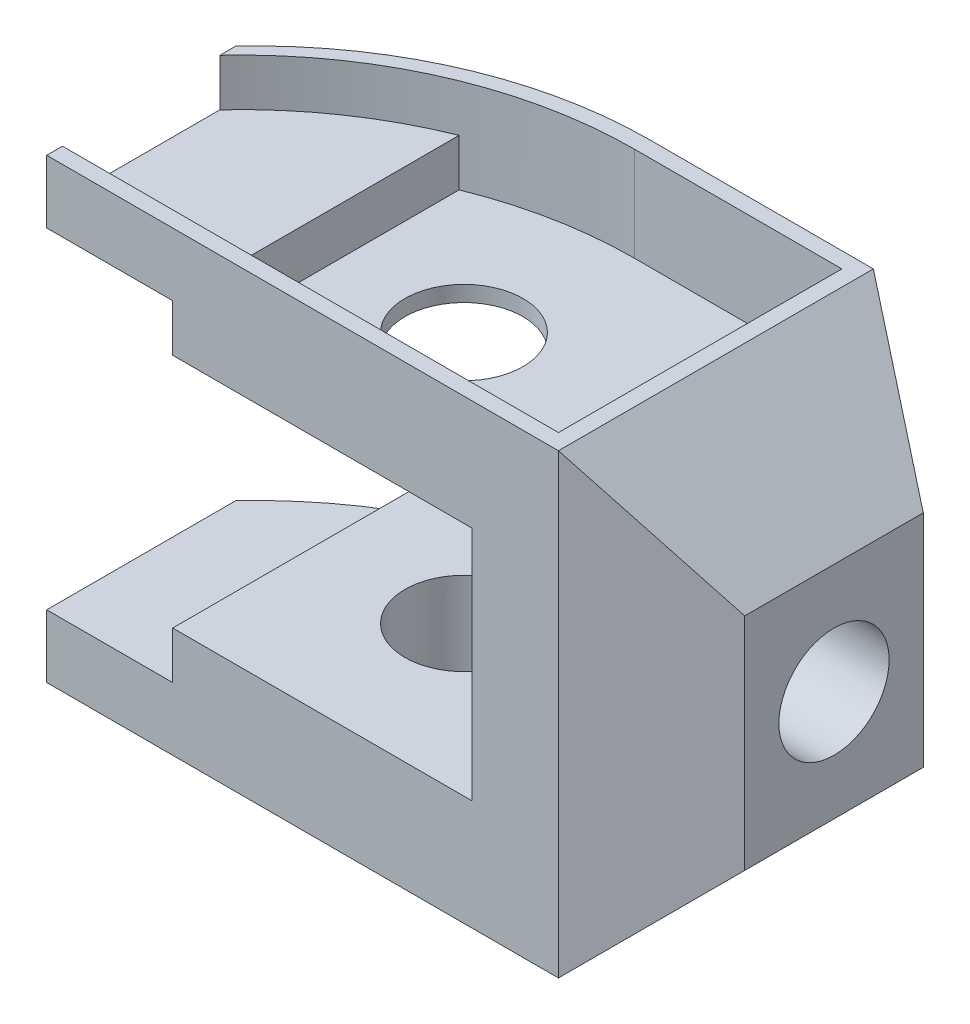
ISO-10303-21;
HEADER;
FILE_DESCRIPTION(('STEP AP214'),'2;1');
FILE_NAME('part.step','',(''),(''),'','','');
FILE_SCHEMA(('AUTOMOTIVE_DESIGN { 1 0 10303 214 1 1 1 1 }'));
ENDSEC;
DATA;
#1=APPLICATION_CONTEXT('core data for automotive mechanical design processes');
#2=APPLICATION_PROTOCOL_DEFINITION('international standard','automotive_design',2000,#1);
#3=PRODUCT_CONTEXT('',#1,'mechanical');
#4=PRODUCT('Part','Part','',(#3));
#5=PRODUCT_RELATED_PRODUCT_CATEGORY('part','',(#4));
#6=PRODUCT_DEFINITION_FORMATION('','',#4);
#7=PRODUCT_DEFINITION_CONTEXT('part definition',#1,'design');
#8=PRODUCT_DEFINITION('design','',#6,#7);
#9=PRODUCT_DEFINITION_SHAPE('','',#8);
#10=(LENGTH_UNIT() NAMED_UNIT(*) SI_UNIT(.MILLI.,.METRE.));
#11=(NAMED_UNIT(*) PLANE_ANGLE_UNIT() SI_UNIT($,.RADIAN.));
#12=(NAMED_UNIT(*) SI_UNIT($,.STERADIAN.) SOLID_ANGLE_UNIT());
#13=UNCERTAINTY_MEASURE_WITH_UNIT(LENGTH_MEASURE(1.E-05),#10,'distance_accuracy_value','');
#14=(GEOMETRIC_REPRESENTATION_CONTEXT(3) GLOBAL_UNCERTAINTY_ASSIGNED_CONTEXT((#13)) GLOBAL_UNIT_ASSIGNED_CONTEXT((#10,
#11,#12)) REPRESENTATION_CONTEXT('',''));
#15=CARTESIAN_POINT('',(0.,0.,0.));
#16=DIRECTION('',(0.,0.,1.));
#17=DIRECTION('',(1.,0.,0.));
#18=AXIS2_PLACEMENT_3D('',#15,#16,#17);
#19=CARTESIAN_POINT('',(0.,58.,0.));
#20=DIRECTION('',(0.,-1.,0.));
#21=DIRECTION('',(0.,0.,-1.));
#22=AXIS2_PLACEMENT_3D('',#19,#20,#21);
#23=CYLINDRICAL_SURFACE('',#22,7.5);
#24=CARTESIAN_POINT('',(0.,44.,0.));
#25=DIRECTION('',(0.,1.,0.));
#26=DIRECTION('',(0.,0.,1.));
#27=AXIS2_PLACEMENT_3D('',#24,#25,#26);
#28=CIRCLE('',#27,7.5);
#29=CARTESIAN_POINT('',(0.,44.,7.5));
#30=VERTEX_POINT('',#29);
#31=EDGE_CURVE('E288',#30,#30,#28,.T.);
#32=ORIENTED_EDGE('',*,*,#31,.F.);
#33=EDGE_LOOP('',(#32));
#34=FACE_BOUND('',#33,.T.);
#35=CARTESIAN_POINT('',(0.,46.,0.));
#36=DIRECTION('',(0.,1.,0.));
#37=DIRECTION('',(0.,0.,1.));
#38=AXIS2_PLACEMENT_3D('',#35,#36,#37);
#39=CIRCLE('',#38,7.5);
#40=CARTESIAN_POINT('',(0.,46.,7.5));
#41=VERTEX_POINT('',#40);
#42=EDGE_CURVE('E40',#41,#41,#39,.T.);
#43=ORIENTED_EDGE('',*,*,#42,.T.);
#44=EDGE_LOOP('',(#43));
#45=FACE_BOUND('',#44,.T.);
#46=ADVANCED_FACE('F36',(#34,#45),#23,.F.);
#47=CARTESIAN_POINT('',(2.66060555964672,58.,29.));
#48=DIRECTION('',(0.,-1.,0.));
#49=DIRECTION('',(0.,0.,-1.));
#50=AXIS2_PLACEMENT_3D('',#47,#48,#49);
#51=CYLINDRICAL_SURFACE('',#50,50.);
#52=DIRECTION('',(0.,-1.,0.));
#53=VECTOR('',#52,1.);
#54=CARTESIAN_POINT('',(-18.,58.,-16.5317403347236));
#55=LINE('',#54,#53);
#56=CARTESIAN_POINT('',(-18.,44.,-16.5317403347236));
#57=VERTEX_POINT('',#56);
#58=CARTESIAN_POINT('',(-18.,50.,-16.5317403347236));
#59=VERTEX_POINT('',#58);
#60=EDGE_CURVE('E304',#57,#59,#55,.F.);
#61=ORIENTED_EDGE('',*,*,#60,.T.);
#62=CARTESIAN_POINT('',(2.66060555964672,50.,29.));
#63=DIRECTION('',(0.,1.,0.));
#64=DIRECTION('',(0.,0.,1.));
#65=AXIS2_PLACEMENT_3D('',#62,#63,#64);
#66=CIRCLE('',#65,50.);
#67=CARTESIAN_POINT('',(-34.,50.,-5.));
#68=VERTEX_POINT('',#67);
#69=EDGE_CURVE('E307',#59,#68,#66,.T.);
#70=ORIENTED_EDGE('',*,*,#69,.T.);
#71=DIRECTION('',(0.,-1.,0.));
#72=VECTOR('',#71,1.);
#73=CARTESIAN_POINT('',(-34.,58.,-5.));
#74=LINE('',#73,#72);
#75=CARTESIAN_POINT('',(-34.,58.,-5.));
#76=VERTEX_POINT('',#75);
#77=EDGE_CURVE('E370',#76,#68,#74,.T.);
#78=ORIENTED_EDGE('',*,*,#77,.F.);
#79=CARTESIAN_POINT('',(2.66060555964672,58.,29.));
#80=DIRECTION('',(0.,1.,0.));
#81=DIRECTION('',(0.,0.,1.));
#82=AXIS2_PLACEMENT_3D('',#79,#80,#81);
#83=CIRCLE('',#82,50.);
#84=CARTESIAN_POINT('',(2.66060555964672,58.,-21.));
#85=VERTEX_POINT('',#84);
#86=EDGE_CURVE('E336',#85,#76,#83,.T.);
#87=ORIENTED_EDGE('',*,*,#86,.F.);
#88=DIRECTION('',(0.,-1.,0.));
#89=VECTOR('',#88,1.);
#90=CARTESIAN_POINT('',(2.66060555964672,58.,-21.));
#91=LINE('',#90,#89);
#92=CARTESIAN_POINT('',(2.66060555964672,44.,-21.));
#93=VERTEX_POINT('',#92);
#94=EDGE_CURVE('E374',#85,#93,#91,.T.);
#95=ORIENTED_EDGE('',*,*,#94,.T.);
#96=CARTESIAN_POINT('',(2.66060555964672,44.,29.));
#97=DIRECTION('',(0.,1.,0.));
#98=DIRECTION('',(0.,0.,1.));
#99=AXIS2_PLACEMENT_3D('',#96,#97,#98);
#100=CIRCLE('',#99,50.);
#101=EDGE_CURVE('E292',#93,#57,#100,.T.);
#102=ORIENTED_EDGE('',*,*,#101,.T.);
#103=EDGE_LOOP('',(#61,#70,#78,#87,#95,#102));
#104=FACE_BOUND('',#103,.T.);
#105=ADVANCED_FACE('F408',(#104),#51,.T.);
#106=CARTESIAN_POINT('',(-34.,58.,19.));
#107=DIRECTION('',(1.,0.,0.));
#108=DIRECTION('',(0.,0.,-1.));
#109=AXIS2_PLACEMENT_3D('',#106,#107,#108);
#110=PLANE('',#109);
#111=DIRECTION('',(0.,0.,1.));
#112=VECTOR('',#111,1.);
#113=CARTESIAN_POINT('',(-34.,58.,19.));
#114=LINE('',#113,#112);
#115=CARTESIAN_POINT('',(-34.,58.,17.));
#116=VERTEX_POINT('',#115);
#117=CARTESIAN_POINT('',(-34.,58.,19.));
#118=VERTEX_POINT('',#117);
#119=EDGE_CURVE('E339',#116,#118,#114,.T.);
#120=ORIENTED_EDGE('',*,*,#119,.F.);
#121=DIRECTION('',(0.,1.,0.));
#122=VECTOR('',#121,1.);
#123=CARTESIAN_POINT('',(-34.,52.,17.));
#124=LINE('',#123,#122);
#125=CARTESIAN_POINT('',(-34.,52.,17.));
#126=VERTEX_POINT('',#125);
#127=EDGE_CURVE('E243',#126,#116,#124,.T.);
#128=ORIENTED_EDGE('',*,*,#127,.F.);
#129=DIRECTION('',(0.,0.,1.));
#130=VECTOR('',#129,1.);
#131=CARTESIAN_POINT('',(-34.,52.,-3.00000000000001));
#132=LINE('',#131,#130);
#133=CARTESIAN_POINT('',(-34.,52.,-3.00000000000002));
#134=VERTEX_POINT('',#133);
#135=EDGE_CURVE('E229',#134,#126,#132,.T.);
#136=ORIENTED_EDGE('',*,*,#135,.F.);
#137=DIRECTION('',(0.,1.,0.));
#138=VECTOR('',#137,1.);
#139=CARTESIAN_POINT('',(-34.,52.,-3.00000000000002));
#140=LINE('',#139,#138);
#141=CARTESIAN_POINT('',(-34.,58.,-3.00000000000002));
#142=VERTEX_POINT('',#141);
#143=EDGE_CURVE('E245',#134,#142,#140,.T.);
#144=ORIENTED_EDGE('',*,*,#143,.T.);
#145=EDGE_CURVE('E340',#76,#142,#114,.T.);
#146=ORIENTED_EDGE('',*,*,#145,.F.);
#147=ORIENTED_EDGE('',*,*,#77,.T.);
#148=DIRECTION('',(0.,0.,1.));
#149=VECTOR('',#148,1.);
#150=CARTESIAN_POINT('',(-34.,50.,-45.));
#151=LINE('',#150,#149);
#152=CARTESIAN_POINT('',(-34.,50.,19.));
#153=VERTEX_POINT('',#152);
#154=EDGE_CURVE('E249',#68,#153,#151,.T.);
#155=ORIENTED_EDGE('',*,*,#154,.T.);
#156=DIRECTION('',(0.,-1.,0.));
#157=VECTOR('',#156,1.);
#158=CARTESIAN_POINT('',(-34.,58.,19.));
#159=LINE('',#158,#157);
#160=EDGE_CURVE('E366',#118,#153,#159,.T.);
#161=ORIENTED_EDGE('',*,*,#160,.F.);
#162=EDGE_LOOP('',(#120,#128,#136,#144,#146,#147,#155,#161));
#163=FACE_BOUND('',#162,.T.);
#164=ADVANCED_FACE('F413',(#163),#110,.F.);
#165=CARTESIAN_POINT('',(2.66060555964672,58.,29.));
#166=DIRECTION('',(0.,1.,0.));
#167=DIRECTION('',(0.,0.,1.));
#168=AXIS2_PLACEMENT_3D('',#165,#166,#167);
#169=PLANE('',#168);
#170=DIRECTION('',(1.,0.,0.));
#171=VECTOR('',#170,1.);
#172=CARTESIAN_POINT('',(-34.,58.,17.));
#173=LINE('',#172,#171);
#174=CARTESIAN_POINT('',(29.,58.,17.));
#175=VERTEX_POINT('',#174);
#176=EDGE_CURVE('E230',#116,#175,#173,.T.);
#177=ORIENTED_EDGE('',*,*,#176,.F.);
#178=ORIENTED_EDGE('',*,*,#119,.T.);
#179=DIRECTION('',(1.,0.,0.));
#180=VECTOR('',#179,1.);
#181=CARTESIAN_POINT('',(0.,58.,19.));
#182=LINE('',#181,#180);
#183=CARTESIAN_POINT('',(31.,58.,19.));
#184=VERTEX_POINT('',#183);
#185=EDGE_CURVE('E343',#118,#184,#182,.T.);
#186=ORIENTED_EDGE('',*,*,#185,.T.);
#187=DIRECTION('',(0.,0.,1.));
#188=VECTOR('',#187,1.);
#189=CARTESIAN_POINT('',(31.,58.,-29.));
#190=LINE('',#189,#188);
#191=CARTESIAN_POINT('',(31.,58.,-21.));
#192=VERTEX_POINT('',#191);
#193=EDGE_CURVE('E313',#192,#184,#190,.T.);
#194=ORIENTED_EDGE('',*,*,#193,.F.);
#195=DIRECTION('',(-1.,0.,0.));
#196=VECTOR('',#195,1.);
#197=CARTESIAN_POINT('',(31.,58.,-21.));
#198=LINE('',#197,#196);
#199=EDGE_CURVE('E334',#192,#85,#198,.T.);
#200=ORIENTED_EDGE('',*,*,#199,.T.);
#201=ORIENTED_EDGE('',*,*,#86,.T.);
#202=ORIENTED_EDGE('',*,*,#145,.T.);
#203=CARTESIAN_POINT('',(2.66060555964672,58.,31.));
#204=DIRECTION('',(0.,1.,0.));
#205=DIRECTION('',(0.,0.,1.));
#206=AXIS2_PLACEMENT_3D('',#203,#204,#205);
#207=CIRCLE('',#206,50.);
#208=CARTESIAN_POINT('',(2.66060555964672,58.,-19.));
#209=VERTEX_POINT('',#208);
#210=EDGE_CURVE('E237',#209,#142,#207,.T.);
#211=ORIENTED_EDGE('',*,*,#210,.F.);
#212=DIRECTION('',(-1.,0.,0.));
#213=VECTOR('',#212,1.);
#214=CARTESIAN_POINT('',(29.,58.,-19.));
#215=LINE('',#214,#213);
#216=CARTESIAN_POINT('',(29.,58.,-19.));
#217=VERTEX_POINT('',#216);
#218=EDGE_CURVE('E235',#217,#209,#215,.T.);
#219=ORIENTED_EDGE('',*,*,#218,.F.);
#220=DIRECTION('',(0.,0.,-1.));
#221=VECTOR('',#220,1.);
#222=CARTESIAN_POINT('',(29.,58.,-19.));
#223=LINE('',#222,#221);
#224=EDGE_CURVE('E52',#175,#217,#223,.T.);
#225=ORIENTED_EDGE('',*,*,#224,.F.);
#226=EDGE_LOOP('',(#177,#178,#186,#194,#200,#201,#202,#211,#219,#225));
#227=FACE_BOUND('',#226,.T.);
#228=ADVANCED_FACE('F420',(#227),#169,.T.);
#229=CARTESIAN_POINT('',(2.66060555964672,0.,29.));
#230=DIRECTION('',(0.,1.,0.));
#231=DIRECTION('',(0.,0.,1.));
#232=AXIS2_PLACEMENT_3D('',#229,#230,#231);
#233=PLANE('',#232);
#234=DIRECTION('',(-1.,0.,0.));
#235=VECTOR('',#234,1.);
#236=CARTESIAN_POINT('',(31.,0.,-21.));
#237=LINE('',#236,#235);
#238=CARTESIAN_POINT('',(31.,0.,-21.));
#239=VERTEX_POINT('',#238);
#240=CARTESIAN_POINT('',(2.66060555964672,0.,-21.));
#241=VERTEX_POINT('',#240);
#242=EDGE_CURVE('E333',#239,#241,#237,.T.);
#243=ORIENTED_EDGE('',*,*,#242,.F.);
#244=DIRECTION('',(0.,0.,1.));
#245=VECTOR('',#244,1.);
#246=CARTESIAN_POINT('',(31.,0.,-29.));
#247=LINE('',#246,#245);
#248=CARTESIAN_POINT('',(31.,0.,19.));
#249=VERTEX_POINT('',#248);
#250=EDGE_CURVE('E314',#239,#249,#247,.T.);
#251=ORIENTED_EDGE('',*,*,#250,.T.);
#252=DIRECTION('',(1.,0.,0.));
#253=VECTOR('',#252,1.);
#254=CARTESIAN_POINT('',(0.,0.,19.));
#255=LINE('',#254,#253);
#256=CARTESIAN_POINT('',(-34.,0.,19.));
#257=VERTEX_POINT('',#256);
#258=EDGE_CURVE('E337',#257,#249,#255,.T.);
#259=ORIENTED_EDGE('',*,*,#258,.F.);
#260=DIRECTION('',(0.,0.,1.));
#261=VECTOR('',#260,1.);
#262=CARTESIAN_POINT('',(-34.,0.,19.));
#263=LINE('',#262,#261);
#264=CARTESIAN_POINT('',(-34.,0.,-5.));
#265=VERTEX_POINT('',#264);
#266=EDGE_CURVE('E352',#265,#257,#263,.T.);
#267=ORIENTED_EDGE('',*,*,#266,.F.);
#268=CARTESIAN_POINT('',(2.66060555964672,0.,29.));
#269=DIRECTION('',(0.,1.,0.));
#270=DIRECTION('',(0.,0.,1.));
#271=AXIS2_PLACEMENT_3D('',#268,#269,#270);
#272=CIRCLE('',#271,50.);
#273=EDGE_CURVE('E349',#241,#265,#272,.T.);
#274=ORIENTED_EDGE('',*,*,#273,.F.);
#275=EDGE_LOOP('',(#243,#251,#259,#267,#274));
#276=FACE_BOUND('',#275,.T.);
#277=CARTESIAN_POINT('',(0.,0.,0.));
#278=DIRECTION('',(0.,1.,0.));
#279=DIRECTION('',(0.,0.,1.));
#280=AXIS2_PLACEMENT_3D('',#277,#278,#279);
#281=CIRCLE('',#280,7.5);
#282=CARTESIAN_POINT('',(0.,0.,7.5));
#283=VERTEX_POINT('',#282);
#284=EDGE_CURVE('E330',#283,#283,#281,.T.);
#285=ORIENTED_EDGE('',*,*,#284,.T.);
#286=EDGE_LOOP('',(#285));
#287=FACE_BOUND('',#286,.T.);
#288=ADVANCED_FACE('F452',(#276,#287),#233,.F.);
#289=CARTESIAN_POINT('',(46.,58.,-12.3397459621557));
#290=DIRECTION('',(-0.499999999999995,0.,0.866025403784442));
#291=DIRECTION('',(0.866025403784442,0.,0.499999999999995));
#292=AXIS2_PLACEMENT_3D('',#289,#290,#291);
#293=PLANE('',#292);
#294=DIRECTION('',(0.,-1.,0.));
#295=VECTOR('',#294,1.);
#296=CARTESIAN_POINT('',(46.,58.,-12.3397459621557));
#297=LINE('',#296,#295);
#298=CARTESIAN_POINT('',(46.,43.0000000000002,-12.3397459621557));
#299=VERTEX_POINT('',#298);
#300=CARTESIAN_POINT('',(46.,14.9999999999999,-12.3397459621557));
#301=VERTEX_POINT('',#300);
#302=EDGE_CURVE('E346',#299,#301,#297,.T.);
#303=ORIENTED_EDGE('',*,*,#302,.T.);
#304=DIRECTION('',(-0.654653670707981,-0.654653670707975,-0.377964473009224));
#305=VECTOR('',#304,1.);
#306=CARTESIAN_POINT('',(64.4285714285715,33.4285714285712,-1.70000528708986));
#307=LINE('',#306,#305);
#308=EDGE_CURVE('E327',#301,#239,#307,.T.);
#309=ORIENTED_EDGE('',*,*,#308,.T.);
#310=DIRECTION('',(0.,-1.,0.));
#311=VECTOR('',#310,1.);
#312=CARTESIAN_POINT('',(31.,58.,-21.));
#313=LINE('',#312,#311);
#314=EDGE_CURVE('E377',#192,#239,#313,.T.);
#315=ORIENTED_EDGE('',*,*,#314,.F.);
#316=DIRECTION('',(0.654653670707981,-0.654653670707975,0.377964473009224));
#317=VECTOR('',#316,1.);
#318=CARTESIAN_POINT('',(39.5714285714286,49.4285714285715,-16.0512834069461));
#319=LINE('',#318,#317);
#320=EDGE_CURVE('E321',#192,#299,#319,.T.);
#321=ORIENTED_EDGE('',*,*,#320,.T.);
#322=EDGE_LOOP('',(#303,#309,#315,#321));
#323=FACE_BOUND('',#322,.T.);
#324=ADVANCED_FACE('F38',(#323),#293,.F.);
#325=CARTESIAN_POINT('',(31.,58.,-21.));
#326=DIRECTION('',(0.,0.,1.));
#327=DIRECTION('',(1.,0.,0.));
#328=AXIS2_PLACEMENT_3D('',#325,#326,#327);
#329=PLANE('',#328);
#330=DIRECTION('',(0.,1.,0.));
#331=VECTOR('',#330,1.);
#332=CARTESIAN_POINT('',(20.,58.,-21.));
#333=LINE('',#332,#331);
#334=CARTESIAN_POINT('',(20.,14.,-21.));
#335=VERTEX_POINT('',#334);
#336=CARTESIAN_POINT('',(20.,44.,-21.));
#337=VERTEX_POINT('',#336);
#338=EDGE_CURVE('E275',#335,#337,#333,.T.);
#339=ORIENTED_EDGE('',*,*,#338,.T.);
#340=DIRECTION('',(-1.,0.,0.));
#341=VECTOR('',#340,1.);
#342=CARTESIAN_POINT('',(31.,44.,-21.));
#343=LINE('',#342,#341);
#344=EDGE_CURVE('E295',#337,#93,#343,.T.);
#345=ORIENTED_EDGE('',*,*,#344,.T.);
#346=ORIENTED_EDGE('',*,*,#94,.F.);
#347=ORIENTED_EDGE('',*,*,#199,.F.);
#348=ORIENTED_EDGE('',*,*,#314,.T.);
#349=ORIENTED_EDGE('',*,*,#242,.T.);
#350=CARTESIAN_POINT('',(2.66060555964672,14.,-21.));
#351=VERTEX_POINT('',#350);
#352=EDGE_CURVE('E373',#351,#241,#91,.T.);
#353=ORIENTED_EDGE('',*,*,#352,.F.);
#354=DIRECTION('',(1.,0.,0.));
#355=VECTOR('',#354,1.);
#356=CARTESIAN_POINT('',(31.,14.,-21.));
#357=LINE('',#356,#355);
#358=EDGE_CURVE('E285',#351,#335,#357,.T.);
#359=ORIENTED_EDGE('',*,*,#358,.T.);
#360=EDGE_LOOP('',(#339,#345,#346,#347,#348,#349,#353,#359));
#361=FACE_BOUND('',#360,.T.);
#362=ADVANCED_FACE('F425',(#361),#329,.F.);
#363=DIRECTION('',(0.,-1.,0.));
#364=VECTOR('',#363,1.);
#365=CARTESIAN_POINT('',(-18.,58.,-16.5317403347236));
#366=LINE('',#365,#364);
#367=CARTESIAN_POINT('',(-18.,8.00000000000002,-16.5317403347236));
#368=VERTEX_POINT('',#367);
#369=CARTESIAN_POINT('',(-18.,14.,-16.5317403347236));
#370=VERTEX_POINT('',#369);
#371=EDGE_CURVE('E301',#368,#370,#366,.F.);
#372=ORIENTED_EDGE('',*,*,#371,.T.);
#373=CARTESIAN_POINT('',(2.66060555964672,14.,29.));
#374=DIRECTION('',(0.,-1.,0.));
#375=DIRECTION('',(1.,0.,0.));
#376=AXIS2_PLACEMENT_3D('',#373,#374,#375);
#377=CIRCLE('',#376,50.);
#378=EDGE_CURVE('E282',#370,#351,#377,.T.);
#379=ORIENTED_EDGE('',*,*,#378,.T.);
#380=ORIENTED_EDGE('',*,*,#352,.T.);
#381=ORIENTED_EDGE('',*,*,#273,.T.);
#382=CARTESIAN_POINT('',(-34.,8.00000000000002,-5.));
#383=VERTEX_POINT('',#382);
#384=EDGE_CURVE('E369',#383,#265,#74,.T.);
#385=ORIENTED_EDGE('',*,*,#384,.F.);
#386=CARTESIAN_POINT('',(2.66060555964672,8.00000000000002,29.));
#387=DIRECTION('',(0.,-1.,0.));
#388=DIRECTION('',(0.,0.,-1.));
#389=AXIS2_PLACEMENT_3D('',#386,#387,#388);
#390=CIRCLE('',#389,50.);
#391=EDGE_CURVE('E298',#383,#368,#390,.T.);
#392=ORIENTED_EDGE('',*,*,#391,.T.);
#393=EDGE_LOOP('',(#372,#379,#380,#381,#385,#392));
#394=FACE_BOUND('',#393,.T.);
#395=ADVANCED_FACE('F440',(#394),#51,.T.);
#396=CARTESIAN_POINT('',(-34.,8.00000000000004,19.));
#397=VERTEX_POINT('',#396);
#398=EDGE_CURVE('E365',#397,#257,#159,.T.);
#399=ORIENTED_EDGE('',*,*,#398,.F.);
#400=DIRECTION('',(0.,0.,1.));
#401=VECTOR('',#400,1.);
#402=CARTESIAN_POINT('',(-34.,8.00000000000002,-45.));
#403=LINE('',#402,#401);
#404=EDGE_CURVE('E60',#383,#397,#403,.T.);
#405=ORIENTED_EDGE('',*,*,#404,.F.);
#406=ORIENTED_EDGE('',*,*,#384,.T.);
#407=ORIENTED_EDGE('',*,*,#266,.T.);
#408=EDGE_LOOP('',(#399,#405,#406,#407));
#409=FACE_BOUND('',#408,.T.);
#410=ADVANCED_FACE('F446',(#409),#110,.F.);
#411=CARTESIAN_POINT('',(0.,58.,19.));
#412=DIRECTION('',(0.,0.,-1.));
#413=DIRECTION('',(-1.,0.,0.));
#414=AXIS2_PLACEMENT_3D('',#411,#412,#413);
#415=PLANE('',#414);
#416=ORIENTED_EDGE('',*,*,#160,.T.);
#417=DIRECTION('',(1.,0.,0.));
#418=VECTOR('',#417,1.);
#419=CARTESIAN_POINT('',(0.,50.,19.));
#420=LINE('',#419,#418);
#421=CARTESIAN_POINT('',(-18.,50.,19.));
#422=VERTEX_POINT('',#421);
#423=EDGE_CURVE('E11',#153,#422,#420,.T.);
#424=ORIENTED_EDGE('',*,*,#423,.T.);
#425=DIRECTION('',(0.,-1.,0.));
#426=VECTOR('',#425,1.);
#427=CARTESIAN_POINT('',(-18.,58.,19.));
#428=LINE('',#427,#426);
#429=CARTESIAN_POINT('',(-18.,44.,19.));
#430=VERTEX_POINT('',#429);
#431=EDGE_CURVE('E45',#422,#430,#428,.T.);
#432=ORIENTED_EDGE('',*,*,#431,.T.);
#433=DIRECTION('',(1.,0.,0.));
#434=VECTOR('',#433,1.);
#435=CARTESIAN_POINT('',(0.,44.,19.));
#436=LINE('',#435,#434);
#437=CARTESIAN_POINT('',(20.,44.,19.));
#438=VERTEX_POINT('',#437);
#439=EDGE_CURVE('E289',#430,#438,#436,.T.);
#440=ORIENTED_EDGE('',*,*,#439,.T.);
#441=DIRECTION('',(0.,-1.,0.));
#442=VECTOR('',#441,1.);
#443=CARTESIAN_POINT('',(20.,58.,19.));
#444=LINE('',#443,#442);
#445=CARTESIAN_POINT('',(20.,14.,19.));
#446=VERTEX_POINT('',#445);
#447=EDGE_CURVE('E272',#438,#446,#444,.T.);
#448=ORIENTED_EDGE('',*,*,#447,.T.);
#449=DIRECTION('',(-1.,0.,0.));
#450=VECTOR('',#449,1.);
#451=CARTESIAN_POINT('',(0.,14.,19.));
#452=LINE('',#451,#450);
#453=CARTESIAN_POINT('',(-18.,14.,19.));
#454=VERTEX_POINT('',#453);
#455=EDGE_CURVE('E279',#446,#454,#452,.T.);
#456=ORIENTED_EDGE('',*,*,#455,.T.);
#457=DIRECTION('',(0.,-1.,0.));
#458=VECTOR('',#457,1.);
#459=CARTESIAN_POINT('',(-18.,58.,19.));
#460=LINE('',#459,#458);
#461=CARTESIAN_POINT('',(-18.,8.00000000000002,19.));
#462=VERTEX_POINT('',#461);
#463=EDGE_CURVE('E394',#454,#462,#460,.T.);
#464=ORIENTED_EDGE('',*,*,#463,.T.);
#465=DIRECTION('',(-1.,0.,0.));
#466=VECTOR('',#465,1.);
#467=CARTESIAN_POINT('',(0.,8.00000000000002,19.));
#468=LINE('',#467,#466);
#469=EDGE_CURVE('E386',#462,#397,#468,.T.);
#470=ORIENTED_EDGE('',*,*,#469,.T.);
#471=ORIENTED_EDGE('',*,*,#398,.T.);
#472=ORIENTED_EDGE('',*,*,#258,.T.);
#473=DIRECTION('',(0.,-1.,0.));
#474=VECTOR('',#473,1.);
#475=CARTESIAN_POINT('',(31.,58.,19.));
#476=LINE('',#475,#474);
#477=EDGE_CURVE('E362',#184,#249,#476,.T.);
#478=ORIENTED_EDGE('',*,*,#477,.F.);
#479=ORIENTED_EDGE('',*,*,#185,.F.);
#480=EDGE_LOOP('',(#416,#424,#432,#440,#448,#456,#464,#470,#471,#472,#478,#479));
#481=FACE_BOUND('',#480,.T.);
#482=ADVANCED_FACE('F399',(#481),#415,.F.);
#483=CARTESIAN_POINT('',(31.,58.,19.));
#484=DIRECTION('',(-0.500000000000001,0.,-0.866025403784438));
#485=DIRECTION('',(-0.866025403784438,0.,0.500000000000001));
#486=AXIS2_PLACEMENT_3D('',#483,#484,#485);
#487=PLANE('',#486);
#488=ORIENTED_EDGE('',*,*,#477,.T.);
#489=DIRECTION('',(0.65465367070798,0.654653670707973,-0.37796447300923));
#490=VECTOR('',#489,1.);
#491=CARTESIAN_POINT('',(55.8571428571428,24.8571428571425,4.64872188014358));
#492=LINE('',#491,#490);
#493=CARTESIAN_POINT('',(46.,14.9999999999998,10.3397459621556));
#494=VERTEX_POINT('',#493);
#495=EDGE_CURVE('E324',#249,#494,#492,.T.);
#496=ORIENTED_EDGE('',*,*,#495,.T.);
#497=DIRECTION('',(0.,-1.,0.));
#498=VECTOR('',#497,1.);
#499=CARTESIAN_POINT('',(46.,58.,10.3397459621556));
#500=LINE('',#499,#498);
#501=CARTESIAN_POINT('',(46.,43.0000000000002,10.3397459621556));
#502=VERTEX_POINT('',#501);
#503=EDGE_CURVE('E359',#502,#494,#500,.T.);
#504=ORIENTED_EDGE('',*,*,#503,.F.);
#505=DIRECTION('',(-0.65465367070798,0.654653670707973,0.37796447300923));
#506=VECTOR('',#505,1.);
#507=CARTESIAN_POINT('',(31.,58.,19.));
#508=LINE('',#507,#506);
#509=EDGE_CURVE('E317',#502,#184,#508,.T.);
#510=ORIENTED_EDGE('',*,*,#509,.T.);
#511=EDGE_LOOP('',(#488,#496,#504,#510));
#512=FACE_BOUND('',#511,.T.);
#513=ADVANCED_FACE('F463',(#512),#487,.F.);
#514=CARTESIAN_POINT('',(46.,58.,10.3397459621556));
#515=DIRECTION('',(-1.,0.,0.));
#516=DIRECTION('',(0.,0.,1.));
#517=AXIS2_PLACEMENT_3D('',#514,#515,#516);
#518=PLANE('',#517);
#519=CARTESIAN_POINT('',(46.,29.,-1.));
#520=DIRECTION('',(-1.,0.,0.));
#521=DIRECTION('',(0.,0.,1.));
#522=AXIS2_PLACEMENT_3D('',#519,#520,#521);
#523=CIRCLE('',#522,7.);
#524=CARTESIAN_POINT('',(46.,29.,6.));
#525=VERTEX_POINT('',#524);
#526=EDGE_CURVE('E310',#525,#525,#523,.T.);
#527=ORIENTED_EDGE('',*,*,#526,.T.);
#528=EDGE_LOOP('',(#527));
#529=FACE_BOUND('',#528,.T.);
#530=ORIENTED_EDGE('',*,*,#503,.T.);
#531=DIRECTION('',(0.,0.,-1.));
#532=VECTOR('',#531,1.);
#533=CARTESIAN_POINT('',(46.,14.9999999999998,10.3397459621556));
#534=LINE('',#533,#532);
#535=EDGE_CURVE('E383',#494,#301,#534,.T.);
#536=ORIENTED_EDGE('',*,*,#535,.T.);
#537=ORIENTED_EDGE('',*,*,#302,.F.);
#538=DIRECTION('',(0.,0.,1.));
#539=VECTOR('',#538,1.);
#540=CARTESIAN_POINT('',(46.,43.0000000000002,10.3397459621556));
#541=LINE('',#540,#539);
#542=EDGE_CURVE('E380',#299,#502,#541,.T.);
#543=ORIENTED_EDGE('',*,*,#542,.T.);
#544=EDGE_LOOP('',(#530,#536,#537,#543));
#545=FACE_BOUND('',#544,.T.);
#546=ADVANCED_FACE('F460',(#529,#545),#518,.F.);
#547=CARTESIAN_POINT('',(0.,14.,0.));
#548=DIRECTION('',(0.,-1.,0.));
#549=DIRECTION('',(1.,0.,0.));
#550=AXIS2_PLACEMENT_3D('',#547,#548,#549);
#551=CIRCLE('',#550,7.5);
#552=CARTESIAN_POINT('',(7.5,14.,0.));
#553=VERTEX_POINT('',#552);
#554=EDGE_CURVE('E278',#553,#553,#551,.T.);
#555=ORIENTED_EDGE('',*,*,#554,.F.);
#556=EDGE_LOOP('',(#555));
#557=FACE_BOUND('',#556,.T.);
#558=ORIENTED_EDGE('',*,*,#284,.F.);
#559=EDGE_LOOP('',(#558));
#560=FACE_BOUND('',#559,.T.);
#561=ADVANCED_FACE('F490',(#557,#560),#23,.F.);
#562=CARTESIAN_POINT('',(31.,58.,-29.));
#563=DIRECTION('',(-0.707106781186544,-0.707106781186551,0.));
#564=DIRECTION('',(0.707106781186551,-0.707106781186544,0.));
#565=AXIS2_PLACEMENT_3D('',#562,#563,#564);
#566=PLANE('',#565);
#567=ORIENTED_EDGE('',*,*,#193,.T.);
#568=ORIENTED_EDGE('',*,*,#509,.F.);
#569=ORIENTED_EDGE('',*,*,#542,.F.);
#570=ORIENTED_EDGE('',*,*,#320,.F.);
#571=EDGE_LOOP('',(#567,#568,#569,#570));
#572=FACE_BOUND('',#571,.T.);
#573=ADVANCED_FACE('F502',(#572),#566,.F.);
#574=CARTESIAN_POINT('',(31.,0.,-29.));
#575=DIRECTION('',(-0.707106781186544,0.707106781186551,0.));
#576=DIRECTION('',(-0.707106781186551,-0.707106781186544,0.));
#577=AXIS2_PLACEMENT_3D('',#574,#575,#576);
#578=PLANE('',#577);
#579=ORIENTED_EDGE('',*,*,#535,.F.);
#580=ORIENTED_EDGE('',*,*,#495,.F.);
#581=ORIENTED_EDGE('',*,*,#250,.F.);
#582=ORIENTED_EDGE('',*,*,#308,.F.);
#583=EDGE_LOOP('',(#579,#580,#581,#582));
#584=FACE_BOUND('',#583,.T.);
#585=ADVANCED_FACE('F456',(#584),#578,.F.);
#586=CARTESIAN_POINT('',(-64.,29.,-1.));
#587=DIRECTION('',(1.,0.,0.));
#588=DIRECTION('',(0.,0.,-1.));
#589=AXIS2_PLACEMENT_3D('',#586,#587,#588);
#590=CYLINDRICAL_SURFACE('',#589,7.);
#591=CARTESIAN_POINT('',(20.,29.,-1.));
#592=DIRECTION('',(1.,0.,0.));
#593=DIRECTION('',(0.,0.,-1.));
#594=AXIS2_PLACEMENT_3D('',#591,#592,#593);
#595=CIRCLE('',#594,7.);
#596=CARTESIAN_POINT('',(20.,29.,-8.));
#597=VERTEX_POINT('',#596);
#598=EDGE_CURVE('E252',#597,#597,#595,.F.);
#599=ORIENTED_EDGE('',*,*,#598,.T.);
#600=EDGE_LOOP('',(#599));
#601=FACE_BOUND('',#600,.T.);
#602=ORIENTED_EDGE('',*,*,#526,.F.);
#603=EDGE_LOOP('',(#602));
#604=FACE_BOUND('',#603,.T.);
#605=ADVANCED_FACE('F592',(#601,#604),#590,.F.);
#606=CARTESIAN_POINT('',(-34.,50.,-45.));
#607=DIRECTION('',(0.,1.,0.));
#608=DIRECTION('',(0.,0.,1.));
#609=AXIS2_PLACEMENT_3D('',#606,#607,#608);
#610=PLANE('',#609);
#611=DIRECTION('',(0.,0.,1.));
#612=VECTOR('',#611,1.);
#613=CARTESIAN_POINT('',(-18.,50.,-45.));
#614=LINE('',#613,#612);
#615=EDGE_CURVE('E253',#59,#422,#614,.T.);
#616=ORIENTED_EDGE('',*,*,#615,.T.);
#617=ORIENTED_EDGE('',*,*,#423,.F.);
#618=ORIENTED_EDGE('',*,*,#154,.F.);
#619=ORIENTED_EDGE('',*,*,#69,.F.);
#620=EDGE_LOOP('',(#616,#617,#618,#619));
#621=FACE_BOUND('',#620,.T.);
#622=ADVANCED_FACE('F405',(#621),#610,.F.);
#623=CARTESIAN_POINT('',(-18.,50.,-45.));
#624=DIRECTION('',(1.,0.,0.));
#625=DIRECTION('',(0.,0.,-1.));
#626=AXIS2_PLACEMENT_3D('',#623,#624,#625);
#627=PLANE('',#626);
#628=DIRECTION('',(0.,0.,1.));
#629=VECTOR('',#628,1.);
#630=CARTESIAN_POINT('',(-18.,44.,-45.));
#631=LINE('',#630,#629);
#632=EDGE_CURVE('E256',#57,#430,#631,.T.);
#633=ORIENTED_EDGE('',*,*,#632,.T.);
#634=ORIENTED_EDGE('',*,*,#431,.F.);
#635=ORIENTED_EDGE('',*,*,#615,.F.);
#636=ORIENTED_EDGE('',*,*,#60,.F.);
#637=EDGE_LOOP('',(#633,#634,#635,#636));
#638=FACE_BOUND('',#637,.T.);
#639=ADVANCED_FACE('F402',(#638),#627,.F.);
#640=CARTESIAN_POINT('',(-18.,8.00000000000002,-45.));
#641=DIRECTION('',(1.,0.,0.));
#642=DIRECTION('',(0.,0.,-1.));
#643=AXIS2_PLACEMENT_3D('',#640,#641,#642);
#644=PLANE('',#643);
#645=DIRECTION('',(0.,0.,1.));
#646=VECTOR('',#645,1.);
#647=CARTESIAN_POINT('',(-18.,8.00000000000002,-45.));
#648=LINE('',#647,#646);
#649=EDGE_CURVE('E268',#368,#462,#648,.T.);
#650=ORIENTED_EDGE('',*,*,#649,.T.);
#651=ORIENTED_EDGE('',*,*,#463,.F.);
#652=DIRECTION('',(0.,0.,1.));
#653=VECTOR('',#652,1.);
#654=CARTESIAN_POINT('',(-18.,14.,-45.));
#655=LINE('',#654,#653);
#656=EDGE_CURVE('E265',#370,#454,#655,.T.);
#657=ORIENTED_EDGE('',*,*,#656,.F.);
#658=ORIENTED_EDGE('',*,*,#371,.F.);
#659=EDGE_LOOP('',(#650,#651,#657,#658));
#660=FACE_BOUND('',#659,.T.);
#661=ADVANCED_FACE('F437',(#660),#644,.F.);
#662=CARTESIAN_POINT('',(-34.,8.00000000000002,-45.));
#663=DIRECTION('',(0.,-1.,0.));
#664=DIRECTION('',(0.,0.,-1.));
#665=AXIS2_PLACEMENT_3D('',#662,#663,#664);
#666=PLANE('',#665);
#667=ORIENTED_EDGE('',*,*,#404,.T.);
#668=ORIENTED_EDGE('',*,*,#469,.F.);
#669=ORIENTED_EDGE('',*,*,#649,.F.);
#670=ORIENTED_EDGE('',*,*,#391,.F.);
#671=EDGE_LOOP('',(#667,#668,#669,#670));
#672=FACE_BOUND('',#671,.T.);
#673=ADVANCED_FACE('F443',(#672),#666,.F.);
#674=CARTESIAN_POINT('',(-18.,44.,-45.));
#675=DIRECTION('',(0.,1.,0.));
#676=DIRECTION('',(0.,0.,1.));
#677=AXIS2_PLACEMENT_3D('',#674,#675,#676);
#678=PLANE('',#677);
#679=ORIENTED_EDGE('',*,*,#31,.T.);
#680=EDGE_LOOP('',(#679));
#681=FACE_BOUND('',#680,.T.);
#682=DIRECTION('',(0.,0.,1.));
#683=VECTOR('',#682,1.);
#684=CARTESIAN_POINT('',(20.,44.,-45.));
#685=LINE('',#684,#683);
#686=EDGE_CURVE('E259',#337,#438,#685,.T.);
#687=ORIENTED_EDGE('',*,*,#686,.T.);
#688=ORIENTED_EDGE('',*,*,#439,.F.);
#689=ORIENTED_EDGE('',*,*,#632,.F.);
#690=ORIENTED_EDGE('',*,*,#101,.F.);
#691=ORIENTED_EDGE('',*,*,#344,.F.);
#692=EDGE_LOOP('',(#687,#688,#689,#690,#691));
#693=FACE_BOUND('',#692,.T.);
#694=ADVANCED_FACE('F429',(#681,#693),#678,.F.);
#695=CARTESIAN_POINT('',(-18.,14.,-45.));
#696=DIRECTION('',(0.,-1.,0.));
#697=DIRECTION('',(1.,0.,0.));
#698=AXIS2_PLACEMENT_3D('',#695,#696,#697);
#699=PLANE('',#698);
#700=ORIENTED_EDGE('',*,*,#554,.T.);
#701=EDGE_LOOP('',(#700));
#702=FACE_BOUND('',#701,.T.);
#703=ORIENTED_EDGE('',*,*,#378,.F.);
#704=ORIENTED_EDGE('',*,*,#656,.T.);
#705=ORIENTED_EDGE('',*,*,#455,.F.);
#706=DIRECTION('',(0.,0.,1.));
#707=VECTOR('',#706,1.);
#708=CARTESIAN_POINT('',(20.,14.,-45.));
#709=LINE('',#708,#707);
#710=EDGE_CURVE('E262',#335,#446,#709,.T.);
#711=ORIENTED_EDGE('',*,*,#710,.F.);
#712=ORIENTED_EDGE('',*,*,#358,.F.);
#713=EDGE_LOOP('',(#703,#704,#705,#711,#712));
#714=FACE_BOUND('',#713,.T.);
#715=ADVANCED_FACE('F434',(#702,#714),#699,.F.);
#716=CARTESIAN_POINT('',(20.,44.,-45.));
#717=DIRECTION('',(1.,0.,0.));
#718=DIRECTION('',(0.,0.,-1.));
#719=AXIS2_PLACEMENT_3D('',#716,#717,#718);
#720=PLANE('',#719);
#721=ORIENTED_EDGE('',*,*,#598,.F.);
#722=EDGE_LOOP('',(#721));
#723=FACE_BOUND('',#722,.T.);
#724=ORIENTED_EDGE('',*,*,#710,.T.);
#725=ORIENTED_EDGE('',*,*,#447,.F.);
#726=ORIENTED_EDGE('',*,*,#686,.F.);
#727=ORIENTED_EDGE('',*,*,#338,.F.);
#728=EDGE_LOOP('',(#724,#725,#726,#727));
#729=FACE_BOUND('',#728,.T.);
#730=ADVANCED_FACE('F431',(#723,#729),#720,.F.);
#731=CARTESIAN_POINT('',(29.,52.,-19.));
#732=DIRECTION('',(1.,0.,0.));
#733=DIRECTION('',(0.,0.,-1.));
#734=AXIS2_PLACEMENT_3D('',#731,#732,#733);
#735=PLANE('',#734);
#736=ORIENTED_EDGE('',*,*,#224,.T.);
#737=DIRECTION('',(0.,1.,0.));
#738=VECTOR('',#737,1.);
#739=CARTESIAN_POINT('',(29.,52.,-19.));
#740=LINE('',#739,#738);
#741=CARTESIAN_POINT('',(29.,46.,-19.));
#742=VERTEX_POINT('',#741);
#743=EDGE_CURVE('E190',#742,#217,#740,.T.);
#744=ORIENTED_EDGE('',*,*,#743,.F.);
#745=DIRECTION('',(0.,0.,-1.));
#746=VECTOR('',#745,1.);
#747=CARTESIAN_POINT('',(29.,46.,17.));
#748=LINE('',#747,#746);
#749=CARTESIAN_POINT('',(29.,46.,17.));
#750=VERTEX_POINT('',#749);
#751=EDGE_CURVE('E194',#750,#742,#748,.T.);
#752=ORIENTED_EDGE('',*,*,#751,.F.);
#753=DIRECTION('',(0.,1.,0.));
#754=VECTOR('',#753,1.);
#755=CARTESIAN_POINT('',(29.,52.,17.));
#756=LINE('',#755,#754);
#757=EDGE_CURVE('E241',#750,#175,#756,.T.);
#758=ORIENTED_EDGE('',*,*,#757,.T.);
#759=EDGE_LOOP('',(#736,#744,#752,#758));
#760=FACE_BOUND('',#759,.T.);
#761=ADVANCED_FACE('F192',(#760),#735,.F.);
#762=CARTESIAN_POINT('',(-34.,52.,17.));
#763=DIRECTION('',(0.,0.,1.));
#764=DIRECTION('',(1.,0.,0.));
#765=AXIS2_PLACEMENT_3D('',#762,#763,#764);
#766=PLANE('',#765);
#767=ORIENTED_EDGE('',*,*,#176,.T.);
#768=ORIENTED_EDGE('',*,*,#757,.F.);
#769=DIRECTION('',(1.,0.,0.));
#770=VECTOR('',#769,1.);
#771=CARTESIAN_POINT('',(-16.,46.,17.));
#772=LINE('',#771,#770);
#773=CARTESIAN_POINT('',(-16.,46.,17.));
#774=VERTEX_POINT('',#773);
#775=EDGE_CURVE('E213',#774,#750,#772,.T.);
#776=ORIENTED_EDGE('',*,*,#775,.F.);
#777=DIRECTION('',(0.,1.,0.));
#778=VECTOR('',#777,1.);
#779=CARTESIAN_POINT('',(-16.,46.,17.));
#780=LINE('',#779,#778);
#781=CARTESIAN_POINT('',(-16.,52.,17.));
#782=VERTEX_POINT('',#781);
#783=EDGE_CURVE('E224',#774,#782,#780,.T.);
#784=ORIENTED_EDGE('',*,*,#783,.T.);
#785=DIRECTION('',(1.,0.,0.));
#786=VECTOR('',#785,1.);
#787=CARTESIAN_POINT('',(-34.,52.,17.));
#788=LINE('',#787,#786);
#789=EDGE_CURVE('E200',#126,#782,#788,.T.);
#790=ORIENTED_EDGE('',*,*,#789,.F.);
#791=ORIENTED_EDGE('',*,*,#127,.T.);
#792=EDGE_LOOP('',(#767,#768,#776,#784,#790,#791));
#793=FACE_BOUND('',#792,.T.);
#794=ADVANCED_FACE('F468',(#793),#766,.F.);
#795=CARTESIAN_POINT('',(2.66060555964672,52.,31.));
#796=DIRECTION('',(0.,1.,0.));
#797=DIRECTION('',(0.,0.,1.));
#798=AXIS2_PLACEMENT_3D('',#795,#796,#797);
#799=CYLINDRICAL_SURFACE('',#798,50.);
#800=ORIENTED_EDGE('',*,*,#210,.T.);
#801=ORIENTED_EDGE('',*,*,#143,.F.);
#802=CARTESIAN_POINT('',(2.66060555964672,52.,31.));
#803=DIRECTION('',(0.,1.,0.));
#804=DIRECTION('',(0.,0.,1.));
#805=AXIS2_PLACEMENT_3D('',#802,#803,#804);
#806=CIRCLE('',#805,50.);
#807=CARTESIAN_POINT('',(-16.,52.,-15.3873021434453));
#808=VERTEX_POINT('',#807);
#809=EDGE_CURVE('E227',#808,#134,#806,.T.);
#810=ORIENTED_EDGE('',*,*,#809,.F.);
#811=DIRECTION('',(0.,1.,0.));
#812=VECTOR('',#811,1.);
#813=CARTESIAN_POINT('',(-16.,46.,-15.3873021434453));
#814=LINE('',#813,#812);
#815=CARTESIAN_POINT('',(-16.,46.,-15.3873021434453));
#816=VERTEX_POINT('',#815);
#817=EDGE_CURVE('E222',#816,#808,#814,.T.);
#818=ORIENTED_EDGE('',*,*,#817,.F.);
#819=CARTESIAN_POINT('',(2.66060555964672,46.,31.));
#820=DIRECTION('',(0.,1.,0.));
#821=DIRECTION('',(0.,0.,1.));
#822=AXIS2_PLACEMENT_3D('',#819,#820,#821);
#823=CIRCLE('',#822,50.);
#824=CARTESIAN_POINT('',(2.66060555964672,46.,-19.));
#825=VERTEX_POINT('',#824);
#826=EDGE_CURVE('E208',#825,#816,#823,.T.);
#827=ORIENTED_EDGE('',*,*,#826,.F.);
#828=DIRECTION('',(0.,1.,0.));
#829=VECTOR('',#828,1.);
#830=CARTESIAN_POINT('',(2.66060555964672,52.,-19.));
#831=LINE('',#830,#829);
#832=EDGE_CURVE('E199',#825,#209,#831,.T.);
#833=ORIENTED_EDGE('',*,*,#832,.T.);
#834=EDGE_LOOP('',(#800,#801,#810,#818,#827,#833));
#835=FACE_BOUND('',#834,.T.);
#836=ADVANCED_FACE('F474',(#835),#799,.F.);
#837=CARTESIAN_POINT('',(29.,52.,-19.));
#838=DIRECTION('',(0.,0.,-1.));
#839=DIRECTION('',(-1.,0.,0.));
#840=AXIS2_PLACEMENT_3D('',#837,#838,#839);
#841=PLANE('',#840);
#842=ORIENTED_EDGE('',*,*,#218,.T.);
#843=ORIENTED_EDGE('',*,*,#832,.F.);
#844=DIRECTION('',(-1.,0.,0.));
#845=VECTOR('',#844,1.);
#846=CARTESIAN_POINT('',(29.,46.,-19.));
#847=LINE('',#846,#845);
#848=EDGE_CURVE('E203',#742,#825,#847,.T.);
#849=ORIENTED_EDGE('',*,*,#848,.F.);
#850=ORIENTED_EDGE('',*,*,#743,.T.);
#851=EDGE_LOOP('',(#842,#843,#849,#850));
#852=FACE_BOUND('',#851,.T.);
#853=ADVANCED_FACE('F204',(#852),#841,.F.);
#854=CARTESIAN_POINT('',(2.66060555964672,52.,31.));
#855=DIRECTION('',(0.,1.,0.));
#856=DIRECTION('',(0.,0.,1.));
#857=AXIS2_PLACEMENT_3D('',#854,#855,#856);
#858=PLANE('',#857);
#859=DIRECTION('',(0.,0.,1.));
#860=VECTOR('',#859,1.);
#861=CARTESIAN_POINT('',(-16.,52.,-15.3873021434453));
#862=LINE('',#861,#860);
#863=EDGE_CURVE('E214',#808,#782,#862,.T.);
#864=ORIENTED_EDGE('',*,*,#863,.F.);
#865=ORIENTED_EDGE('',*,*,#809,.T.);
#866=ORIENTED_EDGE('',*,*,#135,.T.);
#867=ORIENTED_EDGE('',*,*,#789,.T.);
#868=EDGE_LOOP('',(#864,#865,#866,#867));
#869=FACE_BOUND('',#868,.T.);
#870=ADVANCED_FACE('F471',(#869),#858,.T.);
#871=CARTESIAN_POINT('',(-16.,46.,-15.3873021434453));
#872=DIRECTION('',(-1.,0.,0.));
#873=DIRECTION('',(0.,0.,1.));
#874=AXIS2_PLACEMENT_3D('',#871,#872,#873);
#875=PLANE('',#874);
#876=ORIENTED_EDGE('',*,*,#863,.T.);
#877=ORIENTED_EDGE('',*,*,#783,.F.);
#878=DIRECTION('',(0.,0.,1.));
#879=VECTOR('',#878,1.);
#880=CARTESIAN_POINT('',(-16.,46.,-15.3873021434453));
#881=LINE('',#880,#879);
#882=EDGE_CURVE('E220',#816,#774,#881,.T.);
#883=ORIENTED_EDGE('',*,*,#882,.F.);
#884=ORIENTED_EDGE('',*,*,#817,.T.);
#885=EDGE_LOOP('',(#876,#877,#883,#884));
#886=FACE_BOUND('',#885,.T.);
#887=ADVANCED_FACE('F477',(#886),#875,.F.);
#888=CARTESIAN_POINT('',(2.66060555964672,46.,31.));
#889=DIRECTION('',(0.,1.,0.));
#890=DIRECTION('',(0.,0.,1.));
#891=AXIS2_PLACEMENT_3D('',#888,#889,#890);
#892=PLANE('',#891);
#893=ORIENTED_EDGE('',*,*,#42,.F.);
#894=EDGE_LOOP('',(#893));
#895=FACE_BOUND('',#894,.T.);
#896=ORIENTED_EDGE('',*,*,#751,.T.);
#897=ORIENTED_EDGE('',*,*,#848,.T.);
#898=ORIENTED_EDGE('',*,*,#826,.T.);
#899=ORIENTED_EDGE('',*,*,#882,.T.);
#900=ORIENTED_EDGE('',*,*,#775,.T.);
#901=EDGE_LOOP('',(#896,#897,#898,#899,#900));
#902=FACE_BOUND('',#901,.T.);
#903=ADVANCED_FACE('F210',(#895,#902),#892,.T.);
#904=CLOSED_SHELL('',(#46,#105,#164,#228,#288,#324,#362,#395,#410,#482,#513,#546,#561,#573,#585,
#605,#622,#639,#661,#673,#694,#715,#730,#761,#794,#836,#853,#870,#887,#903));
#905=MANIFOLD_SOLID_BREP('B2',#904);
#906=ADVANCED_BREP_SHAPE_REPRESENTATION('',(#18,#905),#14);
#907=SHAPE_DEFINITION_REPRESENTATION(#9,#906);
ENDSEC;
END-ISO-10303-21;
